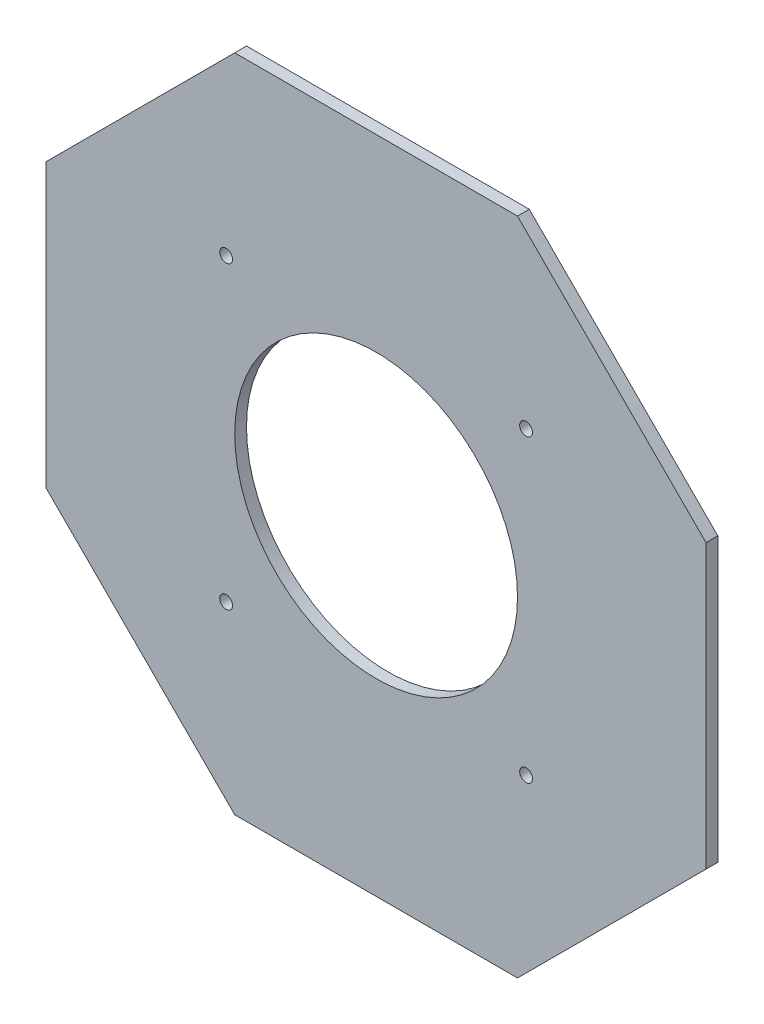
ISO-10303-21;
HEADER;
FILE_DESCRIPTION(('STEP AP214'),'2;1');
FILE_NAME('part.step','',(''),(''),'','','');
FILE_SCHEMA(('AUTOMOTIVE_DESIGN { 1 0 10303 214 1 1 1 1 }'));
ENDSEC;
DATA;
#1=APPLICATION_CONTEXT('core data for automotive mechanical design processes');
#2=APPLICATION_PROTOCOL_DEFINITION('international standard','automotive_design',2000,#1);
#3=PRODUCT_CONTEXT('',#1,'mechanical');
#4=PRODUCT('Part','Part','',(#3));
#5=PRODUCT_RELATED_PRODUCT_CATEGORY('part','',(#4));
#6=PRODUCT_DEFINITION_FORMATION('','',#4);
#7=PRODUCT_DEFINITION_CONTEXT('part definition',#1,'design');
#8=PRODUCT_DEFINITION('design','',#6,#7);
#9=PRODUCT_DEFINITION_SHAPE('','',#8);
#10=(LENGTH_UNIT() NAMED_UNIT(*) SI_UNIT(.MILLI.,.METRE.));
#11=(NAMED_UNIT(*) PLANE_ANGLE_UNIT() SI_UNIT($,.RADIAN.));
#12=(NAMED_UNIT(*) SI_UNIT($,.STERADIAN.) SOLID_ANGLE_UNIT());
#13=UNCERTAINTY_MEASURE_WITH_UNIT(LENGTH_MEASURE(1.E-05),#10,'distance_accuracy_value','');
#14=(GEOMETRIC_REPRESENTATION_CONTEXT(3) GLOBAL_UNCERTAINTY_ASSIGNED_CONTEXT((#13)) GLOBAL_UNIT_ASSIGNED_CONTEXT((#10,
#11,#12)) REPRESENTATION_CONTEXT('',''));
#15=CARTESIAN_POINT('',(0.,0.,0.));
#16=DIRECTION('',(0.,0.,1.));
#17=DIRECTION('',(1.,0.,0.));
#18=AXIS2_PLACEMENT_3D('',#15,#16,#17);
#19=CARTESIAN_POINT('',(88.9,88.9,-3.175));
#20=DIRECTION('',(1.,0.,0.));
#21=DIRECTION('',(0.,1.,0.));
#22=AXIS2_PLACEMENT_3D('',#19,#20,#21);
#23=PLANE('',#22);
#24=DIRECTION('',(0.,1.,0.));
#25=VECTOR('',#24,1.);
#26=CARTESIAN_POINT('',(88.9,88.9,0.));
#27=LINE('',#26,#25);
#28=CARTESIAN_POINT('',(88.9,-38.0999999999998,0.));
#29=VERTEX_POINT('',#28);
#30=CARTESIAN_POINT('',(88.9,38.0999999999999,0.));
#31=VERTEX_POINT('',#30);
#32=EDGE_CURVE('E482',#29,#31,#27,.T.);
#33=ORIENTED_EDGE('',*,*,#32,.F.);
#34=DIRECTION('',(0.,0.,-1.));
#35=VECTOR('',#34,1.);
#36=CARTESIAN_POINT('',(88.9,-38.0999999999998,-3.175));
#37=LINE('',#36,#35);
#38=CARTESIAN_POINT('',(88.9,-38.0999999999998,-3.175));
#39=VERTEX_POINT('',#38);
#40=EDGE_CURVE('E473',#29,#39,#37,.T.);
#41=ORIENTED_EDGE('',*,*,#40,.T.);
#42=DIRECTION('',(0.,1.,0.));
#43=VECTOR('',#42,1.);
#44=CARTESIAN_POINT('',(88.9,88.9,-3.175));
#45=LINE('',#44,#43);
#46=CARTESIAN_POINT('',(88.9,38.0999999999999,-3.175));
#47=VERTEX_POINT('',#46);
#48=EDGE_CURVE('E479',#39,#47,#45,.T.);
#49=ORIENTED_EDGE('',*,*,#48,.T.);
#50=DIRECTION('',(0.,0.,1.));
#51=VECTOR('',#50,1.);
#52=CARTESIAN_POINT('',(88.9,38.0999999999998,-3.175));
#53=LINE('',#52,#51);
#54=EDGE_CURVE('E470',#47,#31,#53,.T.);
#55=ORIENTED_EDGE('',*,*,#54,.T.);
#56=EDGE_LOOP('',(#33,#41,#49,#55));
#57=FACE_BOUND('',#56,.T.);
#58=ADVANCED_FACE('F360',(#57),#23,.T.);
#59=CARTESIAN_POINT('',(-88.9,-88.9,-3.175));
#60=DIRECTION('',(0.,-1.,0.));
#61=DIRECTION('',(1.,0.,0.));
#62=AXIS2_PLACEMENT_3D('',#59,#60,#61);
#63=PLANE('',#62);
#64=DIRECTION('',(1.,0.,0.));
#65=VECTOR('',#64,1.);
#66=CARTESIAN_POINT('',(-88.9,-88.9,0.));
#67=LINE('',#66,#65);
#68=CARTESIAN_POINT('',(-38.0999999999998,-88.9,0.));
#69=VERTEX_POINT('',#68);
#70=CARTESIAN_POINT('',(38.0999999999998,-88.9,0.));
#71=VERTEX_POINT('',#70);
#72=EDGE_CURVE('E443',#69,#71,#67,.T.);
#73=ORIENTED_EDGE('',*,*,#72,.F.);
#74=DIRECTION('',(0.,0.,-1.));
#75=VECTOR('',#74,1.);
#76=CARTESIAN_POINT('',(-38.0999999999998,-88.9,-3.175));
#77=LINE('',#76,#75);
#78=CARTESIAN_POINT('',(-38.0999999999998,-88.9,-3.175));
#79=VERTEX_POINT('',#78);
#80=EDGE_CURVE('E461',#69,#79,#77,.T.);
#81=ORIENTED_EDGE('',*,*,#80,.T.);
#82=DIRECTION('',(1.,0.,0.));
#83=VECTOR('',#82,1.);
#84=CARTESIAN_POINT('',(-88.9,-88.9,-3.175));
#85=LINE('',#84,#83);
#86=CARTESIAN_POINT('',(38.0999999999998,-88.9,-3.175));
#87=VERTEX_POINT('',#86);
#88=EDGE_CURVE('E446',#79,#87,#85,.T.);
#89=ORIENTED_EDGE('',*,*,#88,.T.);
#90=DIRECTION('',(0.,0.,1.));
#91=VECTOR('',#90,1.);
#92=CARTESIAN_POINT('',(38.0999999999998,-88.9,-3.175));
#93=LINE('',#92,#91);
#94=EDGE_CURVE('E458',#87,#71,#93,.T.);
#95=ORIENTED_EDGE('',*,*,#94,.T.);
#96=EDGE_LOOP('',(#73,#81,#89,#95));
#97=FACE_BOUND('',#96,.T.);
#98=ADVANCED_FACE('F495',(#97),#63,.T.);
#99=CARTESIAN_POINT('',(-88.9,88.9,-3.175));
#100=DIRECTION('',(-1.,0.,0.));
#101=DIRECTION('',(0.,0.,1.));
#102=AXIS2_PLACEMENT_3D('',#99,#100,#101);
#103=PLANE('',#102);
#104=DIRECTION('',(0.,-1.,0.));
#105=VECTOR('',#104,1.);
#106=CARTESIAN_POINT('',(-88.9,88.9,-3.175));
#107=LINE('',#106,#105);
#108=CARTESIAN_POINT('',(-88.9,38.0999999999998,-3.175));
#109=VERTEX_POINT('',#108);
#110=CARTESIAN_POINT('',(-88.9,-38.0999999999998,-3.175));
#111=VERTEX_POINT('',#110);
#112=EDGE_CURVE('E450',#109,#111,#107,.T.);
#113=ORIENTED_EDGE('',*,*,#112,.T.);
#114=DIRECTION('',(0.,0.,1.));
#115=VECTOR('',#114,1.);
#116=CARTESIAN_POINT('',(-88.9,-38.0999999999998,-3.175));
#117=LINE('',#116,#115);
#118=CARTESIAN_POINT('',(-88.9,-38.0999999999999,0.));
#119=VERTEX_POINT('',#118);
#120=EDGE_CURVE('E442',#111,#119,#117,.T.);
#121=ORIENTED_EDGE('',*,*,#120,.T.);
#122=DIRECTION('',(0.,-1.,0.));
#123=VECTOR('',#122,1.);
#124=CARTESIAN_POINT('',(-88.9,88.9,0.));
#125=LINE('',#124,#123);
#126=CARTESIAN_POINT('',(-88.9,38.0999999999998,0.));
#127=VERTEX_POINT('',#126);
#128=EDGE_CURVE('E428',#127,#119,#125,.T.);
#129=ORIENTED_EDGE('',*,*,#128,.F.);
#130=DIRECTION('',(0.,0.,-1.));
#131=VECTOR('',#130,1.);
#132=CARTESIAN_POINT('',(-88.9,38.0999999999998,-3.175));
#133=LINE('',#132,#131);
#134=EDGE_CURVE('E440',#127,#109,#133,.T.);
#135=ORIENTED_EDGE('',*,*,#134,.T.);
#136=EDGE_LOOP('',(#113,#121,#129,#135));
#137=FACE_BOUND('',#136,.T.);
#138=ADVANCED_FACE('F439',(#137),#103,.T.);
#139=CARTESIAN_POINT('',(-88.9,88.9,-3.175));
#140=DIRECTION('',(0.,1.,0.));
#141=DIRECTION('',(0.,0.,1.));
#142=AXIS2_PLACEMENT_3D('',#139,#140,#141);
#143=PLANE('',#142);
#144=DIRECTION('',(-1.,0.,0.));
#145=VECTOR('',#144,1.);
#146=CARTESIAN_POINT('',(-88.9,88.9,-3.175));
#147=LINE('',#146,#145);
#148=CARTESIAN_POINT('',(38.0999999999998,88.9,-3.175));
#149=VERTEX_POINT('',#148);
#150=CARTESIAN_POINT('',(-38.0999999999998,88.9,-3.175));
#151=VERTEX_POINT('',#150);
#152=EDGE_CURVE('E488',#149,#151,#147,.T.);
#153=ORIENTED_EDGE('',*,*,#152,.T.);
#154=DIRECTION('',(0.,0.,1.));
#155=VECTOR('',#154,1.);
#156=CARTESIAN_POINT('',(-38.0999999999998,88.9,-3.175));
#157=LINE('',#156,#155);
#158=CARTESIAN_POINT('',(-38.0999999999998,88.9,0.));
#159=VERTEX_POINT('',#158);
#160=EDGE_CURVE('E11',#151,#159,#157,.T.);
#161=ORIENTED_EDGE('',*,*,#160,.T.);
#162=DIRECTION('',(-1.,0.,0.));
#163=VECTOR('',#162,1.);
#164=CARTESIAN_POINT('',(-88.9,88.9,0.));
#165=LINE('',#164,#163);
#166=CARTESIAN_POINT('',(38.0999999999998,88.9,0.));
#167=VERTEX_POINT('',#166);
#168=EDGE_CURVE('E429',#167,#159,#165,.T.);
#169=ORIENTED_EDGE('',*,*,#168,.F.);
#170=DIRECTION('',(0.,0.,-1.));
#171=VECTOR('',#170,1.);
#172=CARTESIAN_POINT('',(38.0999999999998,88.9,-3.175));
#173=LINE('',#172,#171);
#174=EDGE_CURVE('E367',#167,#149,#173,.T.);
#175=ORIENTED_EDGE('',*,*,#174,.T.);
#176=EDGE_LOOP('',(#153,#161,#169,#175));
#177=FACE_BOUND('',#176,.T.);
#178=ADVANCED_FACE('F523',(#177),#143,.T.);
#179=CARTESIAN_POINT('',(88.9,-88.9,-3.175));
#180=DIRECTION('',(0.,0.,1.));
#181=DIRECTION('',(1.,0.,0.));
#182=AXIS2_PLACEMENT_3D('',#179,#180,#181);
#183=PLANE('',#182);
#184=CARTESIAN_POINT('',(40.4111525448111,40.4111525448113,-3.175));
#185=DIRECTION('',(0.,0.,-1.));
#186=DIRECTION('',(-1.,0.,0.));
#187=AXIS2_PLACEMENT_3D('',#184,#185,#186);
#188=CIRCLE('',#187,1.7272);
#189=CARTESIAN_POINT('',(38.6839525448111,40.4111525448113,-3.175));
#190=VERTEX_POINT('',#189);
#191=EDGE_CURVE('E558',#190,#190,#188,.T.);
#192=ORIENTED_EDGE('',*,*,#191,.F.);
#193=EDGE_LOOP('',(#192));
#194=FACE_BOUND('',#193,.T.);
#195=CARTESIAN_POINT('',(-40.4111525448111,40.4111525448113,-3.175));
#196=DIRECTION('',(0.,0.,-1.));
#197=DIRECTION('',(1.,0.,0.));
#198=AXIS2_PLACEMENT_3D('',#195,#196,#197);
#199=CIRCLE('',#198,1.7272);
#200=CARTESIAN_POINT('',(-38.6839525448111,40.4111525448113,-3.175));
#201=VERTEX_POINT('',#200);
#202=EDGE_CURVE('E552',#201,#201,#199,.T.);
#203=ORIENTED_EDGE('',*,*,#202,.F.);
#204=EDGE_LOOP('',(#203));
#205=FACE_BOUND('',#204,.T.);
#206=CARTESIAN_POINT('',(40.4111525448114,-40.411152544811,-3.175));
#207=DIRECTION('',(0.,0.,-1.));
#208=DIRECTION('',(-1.,0.,0.));
#209=AXIS2_PLACEMENT_3D('',#206,#207,#208);
#210=CIRCLE('',#209,1.7272);
#211=CARTESIAN_POINT('',(38.6839525448114,-40.411152544811,-3.175));
#212=VERTEX_POINT('',#211);
#213=EDGE_CURVE('E546',#212,#212,#210,.T.);
#214=ORIENTED_EDGE('',*,*,#213,.F.);
#215=EDGE_LOOP('',(#214));
#216=FACE_BOUND('',#215,.T.);
#217=CARTESIAN_POINT('',(-40.4111525448114,-40.411152544811,-3.175));
#218=DIRECTION('',(0.,0.,-1.));
#219=DIRECTION('',(1.,0.,0.));
#220=AXIS2_PLACEMENT_3D('',#217,#218,#219);
#221=CIRCLE('',#220,1.7272);
#222=CARTESIAN_POINT('',(-38.6839525448114,-40.411152544811,-3.175));
#223=VERTEX_POINT('',#222);
#224=EDGE_CURVE('E542',#223,#223,#221,.T.);
#225=ORIENTED_EDGE('',*,*,#224,.F.);
#226=EDGE_LOOP('',(#225));
#227=FACE_BOUND('',#226,.T.);
#228=CARTESIAN_POINT('',(5.10306314765681E-13,4.62616611288038E-13,-3.175));
#229=DIRECTION('',(0.,0.,1.));
#230=DIRECTION('',(1.,0.,0.));
#231=AXIS2_PLACEMENT_3D('',#228,#229,#230);
#232=CIRCLE('',#231,38.1);
#233=CARTESIAN_POINT('',(38.1000000000005,4.62616611288038E-13,-3.175));
#234=VERTEX_POINT('',#233);
#235=EDGE_CURVE('E534',#234,#234,#232,.T.);
#236=ORIENTED_EDGE('',*,*,#235,.T.);
#237=EDGE_LOOP('',(#236));
#238=FACE_BOUND('',#237,.T.);
#239=ORIENTED_EDGE('',*,*,#88,.F.);
#240=DIRECTION('',(0.707106781186547,-0.707106781186548,0.));
#241=VECTOR('',#240,1.);
#242=CARTESIAN_POINT('',(-88.9,-38.0999999999998,-3.175));
#243=LINE('',#242,#241);
#244=EDGE_CURVE('E468',#79,#111,#243,.F.);
#245=ORIENTED_EDGE('',*,*,#244,.T.);
#246=ORIENTED_EDGE('',*,*,#112,.F.);
#247=DIRECTION('',(-0.707106781186547,-0.707106781186548,0.));
#248=VECTOR('',#247,1.);
#249=CARTESIAN_POINT('',(-38.0999999999998,88.9,-3.175));
#250=LINE('',#249,#248);
#251=EDGE_CURVE('E374',#109,#151,#250,.F.);
#252=ORIENTED_EDGE('',*,*,#251,.T.);
#253=ORIENTED_EDGE('',*,*,#152,.F.);
#254=DIRECTION('',(-0.707106781186547,0.707106781186548,0.));
#255=VECTOR('',#254,1.);
#256=CARTESIAN_POINT('',(88.9,38.0999999999998,-3.175));
#257=LINE('',#256,#255);
#258=EDGE_CURVE('E463',#149,#47,#257,.F.);
#259=ORIENTED_EDGE('',*,*,#258,.T.);
#260=ORIENTED_EDGE('',*,*,#48,.F.);
#261=DIRECTION('',(0.707106781186548,0.707106781186547,0.));
#262=VECTOR('',#261,1.);
#263=CARTESIAN_POINT('',(38.0999999999998,-88.9,-3.175));
#264=LINE('',#263,#262);
#265=EDGE_CURVE('E466',#39,#87,#264,.F.);
#266=ORIENTED_EDGE('',*,*,#265,.T.);
#267=EDGE_LOOP('',(#239,#245,#246,#252,#253,#259,#260,#266));
#268=FACE_BOUND('',#267,.T.);
#269=ADVANCED_FACE('F486',(#194,#205,#216,#227,#238,#268),#183,.F.);
#270=CARTESIAN_POINT('',(88.9,-88.9,0.));
#271=DIRECTION('',(0.,0.,1.));
#272=DIRECTION('',(1.,0.,0.));
#273=AXIS2_PLACEMENT_3D('',#270,#271,#272);
#274=PLANE('',#273);
#275=CARTESIAN_POINT('',(40.4111525448111,40.4111525448113,0.));
#276=DIRECTION('',(0.,0.,1.));
#277=DIRECTION('',(1.,0.,0.));
#278=AXIS2_PLACEMENT_3D('',#275,#276,#277);
#279=CIRCLE('',#278,1.7272);
#280=CARTESIAN_POINT('',(42.1383525448111,40.4111525448113,0.));
#281=VERTEX_POINT('',#280);
#282=EDGE_CURVE('E561',#281,#281,#279,.F.);
#283=ORIENTED_EDGE('',*,*,#282,.T.);
#284=EDGE_LOOP('',(#283));
#285=FACE_BOUND('',#284,.T.);
#286=CARTESIAN_POINT('',(-40.4111525448111,40.4111525448113,0.));
#287=DIRECTION('',(0.,0.,1.));
#288=DIRECTION('',(1.,0.,0.));
#289=AXIS2_PLACEMENT_3D('',#286,#287,#288);
#290=CIRCLE('',#289,1.7272);
#291=CARTESIAN_POINT('',(-38.6839525448111,40.4111525448113,0.));
#292=VERTEX_POINT('',#291);
#293=EDGE_CURVE('E555',#292,#292,#290,.F.);
#294=ORIENTED_EDGE('',*,*,#293,.T.);
#295=EDGE_LOOP('',(#294));
#296=FACE_BOUND('',#295,.T.);
#297=CARTESIAN_POINT('',(40.4111525448114,-40.411152544811,0.));
#298=DIRECTION('',(0.,0.,1.));
#299=DIRECTION('',(1.,0.,0.));
#300=AXIS2_PLACEMENT_3D('',#297,#298,#299);
#301=CIRCLE('',#300,1.7272);
#302=CARTESIAN_POINT('',(42.1383525448114,-40.411152544811,0.));
#303=VERTEX_POINT('',#302);
#304=EDGE_CURVE('E549',#303,#303,#301,.F.);
#305=ORIENTED_EDGE('',*,*,#304,.T.);
#306=EDGE_LOOP('',(#305));
#307=FACE_BOUND('',#306,.T.);
#308=CARTESIAN_POINT('',(-40.4111525448114,-40.411152544811,0.));
#309=DIRECTION('',(0.,0.,1.));
#310=DIRECTION('',(1.,0.,0.));
#311=AXIS2_PLACEMENT_3D('',#308,#309,#310);
#312=CIRCLE('',#311,1.7272);
#313=CARTESIAN_POINT('',(-38.6839525448114,-40.411152544811,0.));
#314=VERTEX_POINT('',#313);
#315=EDGE_CURVE('E543',#314,#314,#312,.F.);
#316=ORIENTED_EDGE('',*,*,#315,.T.);
#317=EDGE_LOOP('',(#316));
#318=FACE_BOUND('',#317,.T.);
#319=CARTESIAN_POINT('',(5.10306314765681E-13,4.62616611288038E-13,0.));
#320=DIRECTION('',(0.,0.,1.));
#321=DIRECTION('',(1.,0.,0.));
#322=AXIS2_PLACEMENT_3D('',#319,#320,#321);
#323=CIRCLE('',#322,38.1);
#324=CARTESIAN_POINT('',(38.1000000000005,4.62616611288038E-13,0.));
#325=VERTEX_POINT('',#324);
#326=EDGE_CURVE('E537',#325,#325,#323,.T.);
#327=ORIENTED_EDGE('',*,*,#326,.F.);
#328=EDGE_LOOP('',(#327));
#329=FACE_BOUND('',#328,.T.);
#330=ORIENTED_EDGE('',*,*,#128,.T.);
#331=DIRECTION('',(-0.707106781186547,0.707106781186548,0.));
#332=VECTOR('',#331,1.);
#333=CARTESIAN_POINT('',(25.4000000000001,-152.4,0.));
#334=LINE('',#333,#332);
#335=EDGE_CURVE('E456',#119,#69,#334,.F.);
#336=ORIENTED_EDGE('',*,*,#335,.T.);
#337=ORIENTED_EDGE('',*,*,#72,.T.);
#338=DIRECTION('',(-0.707106781186548,-0.707106781186547,0.));
#339=VECTOR('',#338,1.);
#340=CARTESIAN_POINT('',(63.4999999999999,-63.4999999999999,0.));
#341=LINE('',#340,#339);
#342=EDGE_CURVE('E433',#71,#29,#341,.F.);
#343=ORIENTED_EDGE('',*,*,#342,.T.);
#344=ORIENTED_EDGE('',*,*,#32,.T.);
#345=DIRECTION('',(0.707106781186547,-0.707106781186548,0.));
#346=VECTOR('',#345,1.);
#347=CARTESIAN_POINT('',(152.4,-25.4000000000001,0.));
#348=LINE('',#347,#346);
#349=EDGE_CURVE('E434',#31,#167,#348,.F.);
#350=ORIENTED_EDGE('',*,*,#349,.T.);
#351=ORIENTED_EDGE('',*,*,#168,.T.);
#352=DIRECTION('',(0.707106781186547,0.707106781186548,0.));
#353=VECTOR('',#352,1.);
#354=CARTESIAN_POINT('',(-63.4999999999999,63.4999999999999,0.));
#355=LINE('',#354,#353);
#356=EDGE_CURVE('E425',#159,#127,#355,.F.);
#357=ORIENTED_EDGE('',*,*,#356,.T.);
#358=EDGE_LOOP('',(#330,#336,#337,#343,#344,#350,#351,#357));
#359=FACE_BOUND('',#358,.T.);
#360=ADVANCED_FACE('F427',(#285,#296,#307,#318,#329,#359),#274,.T.);
#361=CARTESIAN_POINT('',(5.10306314765681E-13,4.62616611288038E-13,-3.175));
#362=DIRECTION('',(0.,0.,1.));
#363=DIRECTION('',(1.,0.,0.));
#364=AXIS2_PLACEMENT_3D('',#361,#362,#363);
#365=CYLINDRICAL_SURFACE('',#364,38.1);
#366=ORIENTED_EDGE('',*,*,#235,.F.);
#367=EDGE_LOOP('',(#366));
#368=FACE_BOUND('',#367,.T.);
#369=ORIENTED_EDGE('',*,*,#326,.T.);
#370=EDGE_LOOP('',(#369));
#371=FACE_BOUND('',#370,.T.);
#372=ADVANCED_FACE('F576',(#368,#371),#365,.F.);
#373=CARTESIAN_POINT('',(-40.4111525448114,-40.411152544811,0.00100000000000013));
#374=DIRECTION('',(0.,0.,-1.));
#375=DIRECTION('',(-1.,0.,0.));
#376=AXIS2_PLACEMENT_3D('',#373,#374,#375);
#377=CYLINDRICAL_SURFACE('',#376,1.7272);
#378=ORIENTED_EDGE('',*,*,#315,.F.);
#379=EDGE_LOOP('',(#378));
#380=FACE_BOUND('',#379,.T.);
#381=ORIENTED_EDGE('',*,*,#224,.T.);
#382=EDGE_LOOP('',(#381));
#383=FACE_BOUND('',#382,.T.);
#384=ADVANCED_FACE('F579',(#380,#383),#377,.F.);
#385=CARTESIAN_POINT('',(40.4111525448114,-40.411152544811,0.00100000000000013));
#386=DIRECTION('',(0.,0.,-1.));
#387=DIRECTION('',(-1.,0.,0.));
#388=AXIS2_PLACEMENT_3D('',#385,#386,#387);
#389=CYLINDRICAL_SURFACE('',#388,1.7272);
#390=ORIENTED_EDGE('',*,*,#304,.F.);
#391=EDGE_LOOP('',(#390));
#392=FACE_BOUND('',#391,.T.);
#393=ORIENTED_EDGE('',*,*,#213,.T.);
#394=EDGE_LOOP('',(#393));
#395=FACE_BOUND('',#394,.T.);
#396=ADVANCED_FACE('F590',(#392,#395),#389,.F.);
#397=CARTESIAN_POINT('',(-40.4111525448111,40.4111525448113,0.00100000000000013));
#398=DIRECTION('',(0.,0.,-1.));
#399=DIRECTION('',(-1.,0.,0.));
#400=AXIS2_PLACEMENT_3D('',#397,#398,#399);
#401=CYLINDRICAL_SURFACE('',#400,1.7272);
#402=ORIENTED_EDGE('',*,*,#293,.F.);
#403=EDGE_LOOP('',(#402));
#404=FACE_BOUND('',#403,.T.);
#405=ORIENTED_EDGE('',*,*,#202,.T.);
#406=EDGE_LOOP('',(#405));
#407=FACE_BOUND('',#406,.T.);
#408=ADVANCED_FACE('F512',(#404,#407),#401,.F.);
#409=CARTESIAN_POINT('',(40.4111525448111,40.4111525448113,0.00100000000000013));
#410=DIRECTION('',(0.,0.,-1.));
#411=DIRECTION('',(-1.,0.,0.));
#412=AXIS2_PLACEMENT_3D('',#409,#410,#411);
#413=CYLINDRICAL_SURFACE('',#412,1.7272);
#414=ORIENTED_EDGE('',*,*,#282,.F.);
#415=EDGE_LOOP('',(#414));
#416=FACE_BOUND('',#415,.T.);
#417=ORIENTED_EDGE('',*,*,#191,.T.);
#418=EDGE_LOOP('',(#417));
#419=FACE_BOUND('',#418,.T.);
#420=ADVANCED_FACE('F504',(#416,#419),#413,.F.);
#421=CARTESIAN_POINT('',(-88.9,-38.0999999999998,-3.175));
#422=DIRECTION('',(0.707106781186548,0.707106781186548,0.));
#423=DIRECTION('',(-0.707106781186547,0.707106781186548,0.));
#424=AXIS2_PLACEMENT_3D('',#421,#422,#423);
#425=PLANE('',#424);
#426=ORIENTED_EDGE('',*,*,#244,.F.);
#427=ORIENTED_EDGE('',*,*,#80,.F.);
#428=ORIENTED_EDGE('',*,*,#335,.F.);
#429=ORIENTED_EDGE('',*,*,#120,.F.);
#430=EDGE_LOOP('',(#426,#427,#428,#429));
#431=FACE_BOUND('',#430,.T.);
#432=ADVANCED_FACE('F502',(#431),#425,.F.);
#433=CARTESIAN_POINT('',(38.0999999999998,-88.9,-3.175));
#434=DIRECTION('',(-0.707106781186547,0.707106781186548,0.));
#435=DIRECTION('',(-0.707106781186548,-0.707106781186547,0.));
#436=AXIS2_PLACEMENT_3D('',#433,#434,#435);
#437=PLANE('',#436);
#438=ORIENTED_EDGE('',*,*,#265,.F.);
#439=ORIENTED_EDGE('',*,*,#40,.F.);
#440=ORIENTED_EDGE('',*,*,#342,.F.);
#441=ORIENTED_EDGE('',*,*,#94,.F.);
#442=EDGE_LOOP('',(#438,#439,#440,#441));
#443=FACE_BOUND('',#442,.T.);
#444=ADVANCED_FACE('F491',(#443),#437,.F.);
#445=CARTESIAN_POINT('',(-38.0999999999998,88.9,-3.175));
#446=DIRECTION('',(0.707106781186548,-0.707106781186547,0.));
#447=DIRECTION('',(0.707106781186547,0.707106781186548,0.));
#448=AXIS2_PLACEMENT_3D('',#445,#446,#447);
#449=PLANE('',#448);
#450=ORIENTED_EDGE('',*,*,#251,.F.);
#451=ORIENTED_EDGE('',*,*,#134,.F.);
#452=ORIENTED_EDGE('',*,*,#356,.F.);
#453=ORIENTED_EDGE('',*,*,#160,.F.);
#454=EDGE_LOOP('',(#450,#451,#452,#453));
#455=FACE_BOUND('',#454,.T.);
#456=ADVANCED_FACE('F445',(#455),#449,.F.);
#457=CARTESIAN_POINT('',(88.9,38.0999999999998,-3.175));
#458=DIRECTION('',(-0.707106781186548,-0.707106781186547,0.));
#459=DIRECTION('',(0.707106781186547,-0.707106781186548,0.));
#460=AXIS2_PLACEMENT_3D('',#457,#458,#459);
#461=PLANE('',#460);
#462=ORIENTED_EDGE('',*,*,#258,.F.);
#463=ORIENTED_EDGE('',*,*,#174,.F.);
#464=ORIENTED_EDGE('',*,*,#349,.F.);
#465=ORIENTED_EDGE('',*,*,#54,.F.);
#466=EDGE_LOOP('',(#462,#463,#464,#465));
#467=FACE_BOUND('',#466,.T.);
#468=ADVANCED_FACE('F533',(#467),#461,.F.);
#469=CLOSED_SHELL('',(#58,#98,#138,#178,#269,#360,#372,#384,#396,#408,#420,#432,#444,#456,#468));
#470=MANIFOLD_SOLID_BREP('B2',#469);
#471=ADVANCED_BREP_SHAPE_REPRESENTATION('',(#18,#470),#14);
#472=SHAPE_DEFINITION_REPRESENTATION(#9,#471);
ENDSEC;
END-ISO-10303-21;
